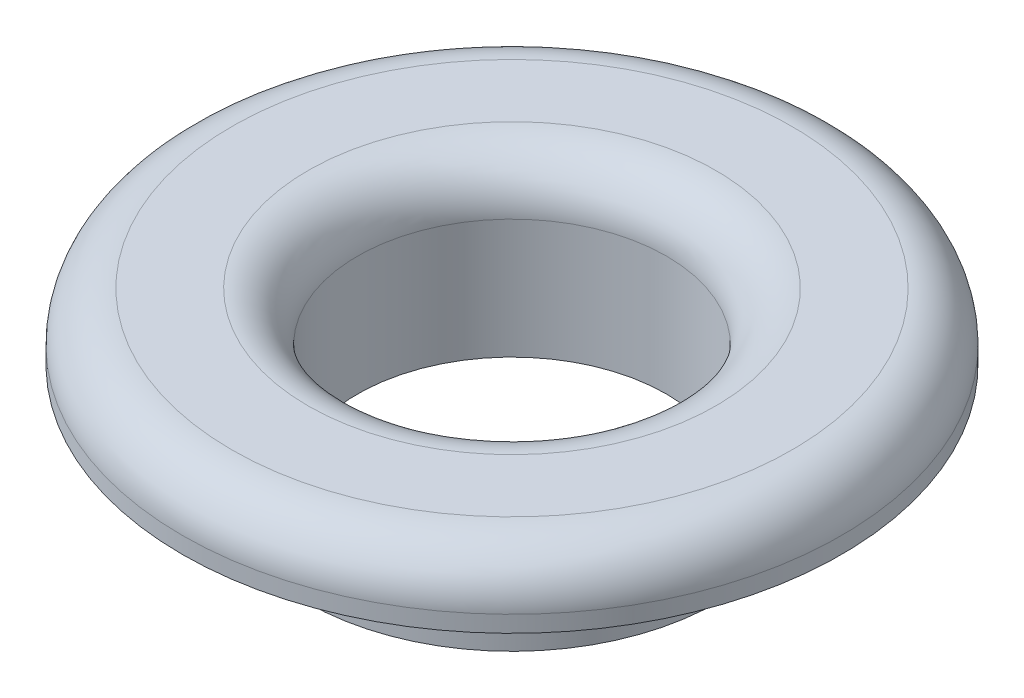
ISO-10303-21;
HEADER;
FILE_DESCRIPTION(('STEP AP214'),'2;1');
FILE_NAME('part.step','',(''),(''),'','','');
FILE_SCHEMA(('AUTOMOTIVE_DESIGN { 1 0 10303 214 1 1 1 1 }'));
ENDSEC;
DATA;
#1=APPLICATION_CONTEXT('core data for automotive mechanical design processes');
#2=APPLICATION_PROTOCOL_DEFINITION('international standard','automotive_design',2000,#1);
#3=PRODUCT_CONTEXT('',#1,'mechanical');
#4=PRODUCT('Part','Part','',(#3));
#5=PRODUCT_RELATED_PRODUCT_CATEGORY('part','',(#4));
#6=PRODUCT_DEFINITION_FORMATION('','',#4);
#7=PRODUCT_DEFINITION_CONTEXT('part definition',#1,'design');
#8=PRODUCT_DEFINITION('design','',#6,#7);
#9=PRODUCT_DEFINITION_SHAPE('','',#8);
#10=(LENGTH_UNIT() NAMED_UNIT(*) SI_UNIT(.MILLI.,.METRE.));
#11=(NAMED_UNIT(*) PLANE_ANGLE_UNIT() SI_UNIT($,.RADIAN.));
#12=(NAMED_UNIT(*) SI_UNIT($,.STERADIAN.) SOLID_ANGLE_UNIT());
#13=UNCERTAINTY_MEASURE_WITH_UNIT(LENGTH_MEASURE(1.E-05),#10,'distance_accuracy_value','');
#14=(GEOMETRIC_REPRESENTATION_CONTEXT(3) GLOBAL_UNCERTAINTY_ASSIGNED_CONTEXT((#13)) GLOBAL_UNIT_ASSIGNED_CONTEXT((#10,
#11,#12)) REPRESENTATION_CONTEXT('',''));
#15=CARTESIAN_POINT('',(0.,0.,0.));
#16=DIRECTION('',(0.,0.,1.));
#17=DIRECTION('',(1.,0.,0.));
#18=AXIS2_PLACEMENT_3D('',#15,#16,#17);
#19=CARTESIAN_POINT('',(0.,0.,0.));
#20=DIRECTION('',(0.,1.,0.));
#21=DIRECTION('',(0.,0.,1.));
#22=AXIS2_PLACEMENT_3D('',#19,#20,#21);
#23=PLANE('',#22);
#24=CARTESIAN_POINT('',(0.,0.,0.));
#25=DIRECTION('',(0.,1.,0.));
#26=DIRECTION('',(0.,0.,1.));
#27=AXIS2_PLACEMENT_3D('',#24,#25,#26);
#28=CIRCLE('',#27,3.175);
#29=CARTESIAN_POINT('',(0.,0.,3.175));
#30=VERTEX_POINT('',#29);
#31=EDGE_CURVE('E52',#30,#30,#28,.T.);
#32=ORIENTED_EDGE('',*,*,#31,.F.);
#33=EDGE_LOOP('',(#32));
#34=FACE_BOUND('',#33,.T.);
#35=CARTESIAN_POINT('',(0.,0.,0.));
#36=DIRECTION('',(0.,1.,0.));
#37=DIRECTION('',(0.,0.,1.));
#38=AXIS2_PLACEMENT_3D('',#35,#36,#37);
#39=CIRCLE('',#38,2.38125);
#40=CARTESIAN_POINT('',(0.,0.,2.38125));
#41=VERTEX_POINT('',#40);
#42=EDGE_CURVE('E55',#41,#41,#39,.T.);
#43=ORIENTED_EDGE('',*,*,#42,.T.);
#44=EDGE_LOOP('',(#43));
#45=FACE_BOUND('',#44,.T.);
#46=ADVANCED_FACE('F31',(#34,#45),#23,.F.);
#47=CARTESIAN_POINT('',(0.,1.5875,0.));
#48=DIRECTION('',(0.,-1.,0.));
#49=DIRECTION('',(0.,0.,-1.));
#50=AXIS2_PLACEMENT_3D('',#47,#48,#49);
#51=CYLINDRICAL_SURFACE('',#50,3.175);
#52=CARTESIAN_POINT('',(0.,1.5875,0.));
#53=DIRECTION('',(0.,1.,0.));
#54=DIRECTION('',(0.,0.,1.));
#55=AXIS2_PLACEMENT_3D('',#52,#53,#54);
#56=CIRCLE('',#55,3.175);
#57=CARTESIAN_POINT('',(0.,1.5875,3.175));
#58=VERTEX_POINT('',#57);
#59=EDGE_CURVE('E51',#58,#58,#56,.T.);
#60=ORIENTED_EDGE('',*,*,#59,.F.);
#61=EDGE_LOOP('',(#60));
#62=FACE_BOUND('',#61,.T.);
#63=ORIENTED_EDGE('',*,*,#31,.T.);
#64=EDGE_LOOP('',(#63));
#65=FACE_BOUND('',#64,.T.);
#66=ADVANCED_FACE('F81',(#62,#65),#51,.T.);
#67=CARTESIAN_POINT('',(0.,1.5875,0.));
#68=DIRECTION('',(0.,-1.,0.));
#69=DIRECTION('',(0.,0.,-1.));
#70=AXIS2_PLACEMENT_3D('',#67,#68,#69);
#71=CYLINDRICAL_SURFACE('',#70,2.38125);
#72=CARTESIAN_POINT('',(0.,1.8415,0.));
#73=DIRECTION('',(0.,1.,0.));
#74=DIRECTION('',(0.,0.,1.));
#75=AXIS2_PLACEMENT_3D('',#72,#73,#74);
#76=CIRCLE('',#75,2.38125);
#77=CARTESIAN_POINT('',(0.,1.8415,2.38125));
#78=VERTEX_POINT('',#77);
#79=EDGE_CURVE('E10',#78,#78,#76,.T.);
#80=ORIENTED_EDGE('',*,*,#79,.T.);
#81=EDGE_LOOP('',(#80));
#82=FACE_BOUND('',#81,.T.);
#83=ORIENTED_EDGE('',*,*,#42,.F.);
#84=EDGE_LOOP('',(#83));
#85=FACE_BOUND('',#84,.T.);
#86=ADVANCED_FACE('F77',(#82,#85),#71,.F.);
#87=CARTESIAN_POINT('',(0.,2.6035,0.));
#88=DIRECTION('',(0.,1.,0.));
#89=DIRECTION('',(0.,0.,1.));
#90=AXIS2_PLACEMENT_3D('',#87,#88,#89);
#91=PLANE('',#90);
#92=CARTESIAN_POINT('',(0.,2.6035,0.));
#93=DIRECTION('',(0.,1.,0.));
#94=DIRECTION('',(0.,0.,1.));
#95=AXIS2_PLACEMENT_3D('',#92,#93,#94);
#96=CIRCLE('',#95,4.318);
#97=CARTESIAN_POINT('',(0.,2.6035,4.318));
#98=VERTEX_POINT('',#97);
#99=EDGE_CURVE('E42',#98,#98,#96,.T.);
#100=ORIENTED_EDGE('',*,*,#99,.T.);
#101=EDGE_LOOP('',(#100));
#102=FACE_BOUND('',#101,.T.);
#103=CARTESIAN_POINT('',(0.,2.6035,0.));
#104=DIRECTION('',(0.,1.,0.));
#105=DIRECTION('',(0.,0.,1.));
#106=AXIS2_PLACEMENT_3D('',#103,#104,#105);
#107=CIRCLE('',#106,3.14325);
#108=CARTESIAN_POINT('',(0.,2.6035,3.14325));
#109=VERTEX_POINT('',#108);
#110=EDGE_CURVE('E46',#109,#109,#107,.F.);
#111=ORIENTED_EDGE('',*,*,#110,.T.);
#112=EDGE_LOOP('',(#111));
#113=FACE_BOUND('',#112,.T.);
#114=ADVANCED_FACE('F68',(#102,#113),#91,.T.);
#115=CARTESIAN_POINT('',(0.,1.5875,0.));
#116=DIRECTION('',(0.,1.,0.));
#117=DIRECTION('',(0.,0.,1.));
#118=AXIS2_PLACEMENT_3D('',#115,#116,#117);
#119=PLANE('',#118);
#120=ORIENTED_EDGE('',*,*,#59,.T.);
#121=EDGE_LOOP('',(#120));
#122=FACE_BOUND('',#121,.T.);
#123=CARTESIAN_POINT('',(0.,1.5875,0.));
#124=DIRECTION('',(0.,1.,0.));
#125=DIRECTION('',(0.,0.,1.));
#126=AXIS2_PLACEMENT_3D('',#123,#124,#125);
#127=CIRCLE('',#126,5.08);
#128=CARTESIAN_POINT('',(0.,1.5875,5.08));
#129=VERTEX_POINT('',#128);
#130=EDGE_CURVE('E60',#129,#129,#127,.T.);
#131=ORIENTED_EDGE('',*,*,#130,.F.);
#132=EDGE_LOOP('',(#131));
#133=FACE_BOUND('',#132,.T.);
#134=ADVANCED_FACE('F66',(#122,#133),#119,.F.);
#135=CARTESIAN_POINT('',(0.,2.6035,0.));
#136=DIRECTION('',(0.,-1.,0.));
#137=DIRECTION('',(0.,0.,-1.));
#138=AXIS2_PLACEMENT_3D('',#135,#136,#137);
#139=CYLINDRICAL_SURFACE('',#138,5.08);
#140=CARTESIAN_POINT('',(0.,1.8415,0.));
#141=DIRECTION('',(0.,1.,0.));
#142=DIRECTION('',(0.,0.,1.));
#143=AXIS2_PLACEMENT_3D('',#140,#141,#142);
#144=CIRCLE('',#143,5.08);
#145=CARTESIAN_POINT('',(0.,1.8415,5.08));
#146=VERTEX_POINT('',#145);
#147=EDGE_CURVE('E38',#146,#146,#144,.F.);
#148=ORIENTED_EDGE('',*,*,#147,.T.);
#149=EDGE_LOOP('',(#148));
#150=FACE_BOUND('',#149,.T.);
#151=ORIENTED_EDGE('',*,*,#130,.T.);
#152=EDGE_LOOP('',(#151));
#153=FACE_BOUND('',#152,.T.);
#154=ADVANCED_FACE('F64',(#150,#153),#139,.T.);
#155=CARTESIAN_POINT('',(0.,1.8415,0.));
#156=DIRECTION('',(0.,1.,0.));
#157=DIRECTION('',(0.,0.,1.));
#158=AXIS2_PLACEMENT_3D('',#155,#156,#157);
#159=TOROIDAL_SURFACE('',#158,4.318,0.762);
#160=ORIENTED_EDGE('',*,*,#147,.F.);
#161=EDGE_LOOP('',(#160));
#162=FACE_BOUND('',#161,.T.);
#163=ORIENTED_EDGE('',*,*,#99,.F.);
#164=EDGE_LOOP('',(#163));
#165=FACE_BOUND('',#164,.T.);
#166=ADVANCED_FACE('F75',(#162,#165),#159,.T.);
#167=CARTESIAN_POINT('',(0.,1.8415,0.));
#168=DIRECTION('',(0.,1.,0.));
#169=DIRECTION('',(0.,0.,1.));
#170=AXIS2_PLACEMENT_3D('',#167,#168,#169);
#171=TOROIDAL_SURFACE('',#170,3.14325,0.762);
#172=ORIENTED_EDGE('',*,*,#110,.F.);
#173=EDGE_LOOP('',(#172));
#174=FACE_BOUND('',#173,.T.);
#175=ORIENTED_EDGE('',*,*,#79,.F.);
#176=EDGE_LOOP('',(#175));
#177=FACE_BOUND('',#176,.T.);
#178=ADVANCED_FACE('F33',(#174,#177),#171,.T.);
#179=CLOSED_SHELL('',(#46,#66,#86,#114,#134,#154,#166,#178));
#180=MANIFOLD_SOLID_BREP('B2',#179);
#181=ADVANCED_BREP_SHAPE_REPRESENTATION('',(#18,#180),#14);
#182=SHAPE_DEFINITION_REPRESENTATION(#9,#181);
ENDSEC;
END-ISO-10303-21;
